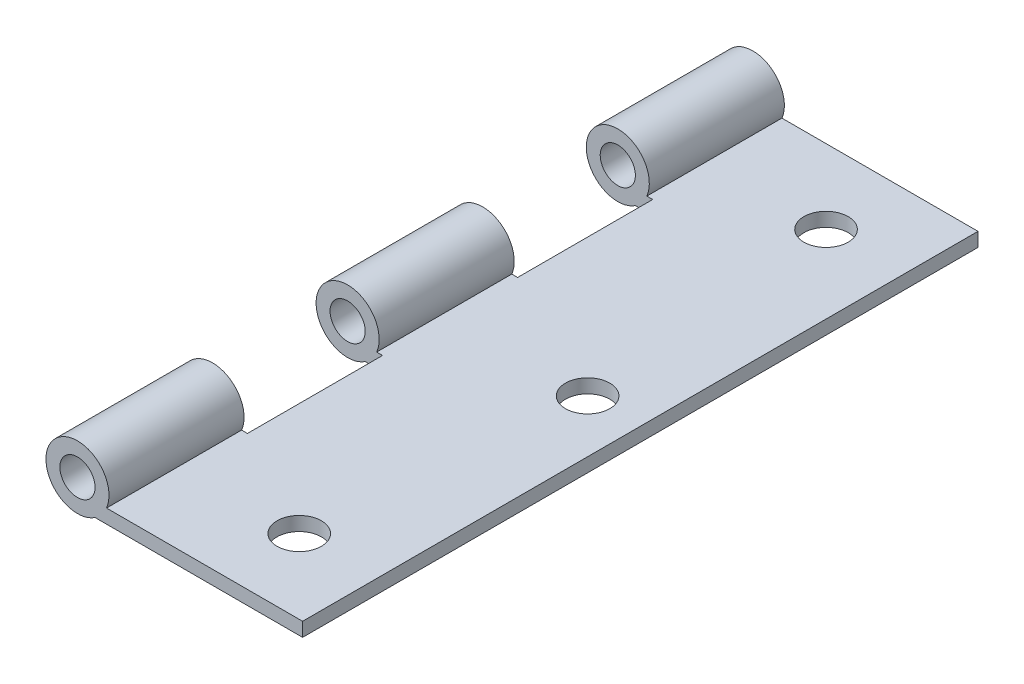
ISO-10303-21;
HEADER;
FILE_DESCRIPTION(('STEP AP214'),'2;1');
FILE_NAME('part.step','',(''),(''),'','','');
FILE_SCHEMA(('AUTOMOTIVE_DESIGN { 1 0 10303 214 1 1 1 1 }'));
ENDSEC;
DATA;
#1=APPLICATION_CONTEXT('core data for automotive mechanical design processes');
#2=APPLICATION_PROTOCOL_DEFINITION('international standard','automotive_design',2000,#1);
#3=PRODUCT_CONTEXT('',#1,'mechanical');
#4=PRODUCT('Part','Part','',(#3));
#5=PRODUCT_RELATED_PRODUCT_CATEGORY('part','',(#4));
#6=PRODUCT_DEFINITION_FORMATION('','',#4);
#7=PRODUCT_DEFINITION_CONTEXT('part definition',#1,'design');
#8=PRODUCT_DEFINITION('design','',#6,#7);
#9=PRODUCT_DEFINITION_SHAPE('','',#8);
#10=(LENGTH_UNIT() NAMED_UNIT(*) SI_UNIT(.MILLI.,.METRE.));
#11=(NAMED_UNIT(*) PLANE_ANGLE_UNIT() SI_UNIT($,.RADIAN.));
#12=(NAMED_UNIT(*) SI_UNIT($,.STERADIAN.) SOLID_ANGLE_UNIT());
#13=UNCERTAINTY_MEASURE_WITH_UNIT(LENGTH_MEASURE(1.E-05),#10,'distance_accuracy_value','');
#14=(GEOMETRIC_REPRESENTATION_CONTEXT(3) GLOBAL_UNCERTAINTY_ASSIGNED_CONTEXT((#13)) GLOBAL_UNIT_ASSIGNED_CONTEXT((#10,
#11,#12)) REPRESENTATION_CONTEXT('',''));
#15=CARTESIAN_POINT('',(0.,0.,0.));
#16=DIRECTION('',(0.,0.,1.));
#17=DIRECTION('',(1.,0.,0.));
#18=AXIS2_PLACEMENT_3D('',#15,#16,#17);
#19=CARTESIAN_POINT('',(1.984375,-2.95082901222266,-38.1));
#20=DIRECTION('',(0.,-1.,0.));
#21=DIRECTION('',(0.,0.,-1.));
#22=AXIS2_PLACEMENT_3D('',#19,#20,#21);
#23=PLANE('',#22);
#24=CARTESIAN_POINT('',(16.637,-2.95082901222266,29.718));
#25=DIRECTION('',(0.,-1.,0.));
#26=DIRECTION('',(0.,0.,-1.));
#27=AXIS2_PLACEMENT_3D('',#24,#25,#26);
#28=CIRCLE('',#27,2.5);
#29=CARTESIAN_POINT('',(16.637,-2.95082901222266,27.218));
#30=VERTEX_POINT('',#29);
#31=EDGE_CURVE('E249',#30,#30,#28,.F.);
#32=ORIENTED_EDGE('',*,*,#31,.T.);
#33=EDGE_LOOP('',(#32));
#34=FACE_BOUND('',#33,.T.);
#35=CARTESIAN_POINT('',(19.4564,-2.95082901222266,0.));
#36=DIRECTION('',(0.,-1.,0.));
#37=DIRECTION('',(0.,0.,-1.));
#38=AXIS2_PLACEMENT_3D('',#35,#36,#37);
#39=CIRCLE('',#38,2.5);
#40=CARTESIAN_POINT('',(19.4564,-2.95082901222266,-2.5));
#41=VERTEX_POINT('',#40);
#42=EDGE_CURVE('E243',#41,#41,#39,.F.);
#43=ORIENTED_EDGE('',*,*,#42,.T.);
#44=EDGE_LOOP('',(#43));
#45=FACE_BOUND('',#44,.T.);
#46=CARTESIAN_POINT('',(16.637,-2.95082901222266,-29.718));
#47=DIRECTION('',(0.,-1.,0.));
#48=DIRECTION('',(0.,0.,-1.));
#49=AXIS2_PLACEMENT_3D('',#46,#47,#48);
#50=CIRCLE('',#49,2.5);
#51=CARTESIAN_POINT('',(16.637,-2.95082901222266,-32.218));
#52=VERTEX_POINT('',#51);
#53=EDGE_CURVE('E237',#52,#52,#50,.F.);
#54=ORIENTED_EDGE('',*,*,#53,.T.);
#55=EDGE_LOOP('',(#54));
#56=FACE_BOUND('',#55,.T.);
#57=DIRECTION('',(0.,0.,1.));
#58=VECTOR('',#57,1.);
#59=CARTESIAN_POINT('',(1.984375,-2.95082901222267,-38.1));
#60=LINE('',#59,#58);
#61=CARTESIAN_POINT('',(1.984375,-2.95082901222266,22.86));
#62=VERTEX_POINT('',#61);
#63=CARTESIAN_POINT('',(1.984375,-2.95082901222267,38.1));
#64=VERTEX_POINT('',#63);
#65=EDGE_CURVE('E43',#62,#64,#60,.T.);
#66=ORIENTED_EDGE('',*,*,#65,.F.);
#67=DIRECTION('',(-1.,0.,0.));
#68=VECTOR('',#67,1.);
#69=CARTESIAN_POINT('',(3.937,-2.95082901222266,22.86));
#70=LINE('',#69,#68);
#71=CARTESIAN_POINT('',(3.937,-2.95082901222266,22.86));
#72=VERTEX_POINT('',#71);
#73=EDGE_CURVE('E131',#72,#62,#70,.T.);
#74=ORIENTED_EDGE('',*,*,#73,.F.);
#75=DIRECTION('',(0.,0.,-1.));
#76=VECTOR('',#75,1.);
#77=CARTESIAN_POINT('',(3.937,-2.95082901222266,22.86));
#78=LINE('',#77,#76);
#79=CARTESIAN_POINT('',(3.937,-2.95082901222266,7.62));
#80=VERTEX_POINT('',#79);
#81=EDGE_CURVE('E197',#72,#80,#78,.T.);
#82=ORIENTED_EDGE('',*,*,#81,.T.);
#83=DIRECTION('',(-1.,0.,0.));
#84=VECTOR('',#83,1.);
#85=CARTESIAN_POINT('',(3.937,-2.95082901222266,7.62));
#86=LINE('',#85,#84);
#87=CARTESIAN_POINT('',(1.984375,-2.95082901222266,7.62));
#88=VERTEX_POINT('',#87);
#89=EDGE_CURVE('E135',#80,#88,#86,.T.);
#90=ORIENTED_EDGE('',*,*,#89,.T.);
#91=CARTESIAN_POINT('',(1.984375,-2.95082901222266,-7.62));
#92=VERTEX_POINT('',#91);
#93=EDGE_CURVE('E41',#92,#88,#60,.T.);
#94=ORIENTED_EDGE('',*,*,#93,.F.);
#95=DIRECTION('',(-1.,0.,0.));
#96=VECTOR('',#95,1.);
#97=CARTESIAN_POINT('',(3.937,-2.95082901222266,-7.62));
#98=LINE('',#97,#96);
#99=CARTESIAN_POINT('',(3.937,-2.95082901222266,-7.62));
#100=VERTEX_POINT('',#99);
#101=EDGE_CURVE('E184',#100,#92,#98,.T.);
#102=ORIENTED_EDGE('',*,*,#101,.F.);
#103=DIRECTION('',(0.,0.,-1.));
#104=VECTOR('',#103,1.);
#105=CARTESIAN_POINT('',(3.937,-2.95082901222266,-7.62));
#106=LINE('',#105,#104);
#107=CARTESIAN_POINT('',(3.937,-2.95082901222266,-22.86));
#108=VERTEX_POINT('',#107);
#109=EDGE_CURVE('E171',#100,#108,#106,.T.);
#110=ORIENTED_EDGE('',*,*,#109,.T.);
#111=DIRECTION('',(-1.,0.,0.));
#112=VECTOR('',#111,1.);
#113=CARTESIAN_POINT('',(3.937,-2.95082901222266,-22.86));
#114=LINE('',#113,#112);
#115=CARTESIAN_POINT('',(1.984375,-2.95082901222266,-22.86));
#116=VERTEX_POINT('',#115);
#117=EDGE_CURVE('E187',#108,#116,#114,.T.);
#118=ORIENTED_EDGE('',*,*,#117,.T.);
#119=CARTESIAN_POINT('',(1.984375,-2.95082901222267,-38.1));
#120=VERTEX_POINT('',#119);
#121=EDGE_CURVE('E11',#120,#116,#60,.T.);
#122=ORIENTED_EDGE('',*,*,#121,.F.);
#123=DIRECTION('',(1.,0.,0.));
#124=VECTOR('',#123,1.);
#125=CARTESIAN_POINT('',(1.984375,-2.95082901222266,-38.1));
#126=LINE('',#125,#124);
#127=CARTESIAN_POINT('',(25.4,-2.95082901222266,-38.1));
#128=VERTEX_POINT('',#127);
#129=EDGE_CURVE('E162',#120,#128,#126,.T.);
#130=ORIENTED_EDGE('',*,*,#129,.T.);
#131=DIRECTION('',(0.,0.,1.));
#132=VECTOR('',#131,1.);
#133=CARTESIAN_POINT('',(25.4,-2.95082901222266,-38.1));
#134=LINE('',#133,#132);
#135=CARTESIAN_POINT('',(25.4,-2.95082901222266,38.1));
#136=VERTEX_POINT('',#135);
#137=EDGE_CURVE('E36',#128,#136,#134,.T.);
#138=ORIENTED_EDGE('',*,*,#137,.T.);
#139=DIRECTION('',(1.,0.,0.));
#140=VECTOR('',#139,1.);
#141=CARTESIAN_POINT('',(1.984375,-2.95082901222266,38.1));
#142=LINE('',#141,#140);
#143=EDGE_CURVE('E168',#64,#136,#142,.T.);
#144=ORIENTED_EDGE('',*,*,#143,.F.);
#145=EDGE_LOOP('',(#66,#74,#82,#90,#94,#102,#110,#118,#122,#130,#138,#144));
#146=FACE_BOUND('',#145,.T.);
#147=ADVANCED_FACE('F33',(#34,#45,#56,#146),#23,.T.);
#148=CARTESIAN_POINT('',(0.,0.,-38.1));
#149=DIRECTION('',(0.,0.,1.));
#150=DIRECTION('',(1.,0.,0.));
#151=AXIS2_PLACEMENT_3D('',#148,#149,#150);
#152=CYLINDRICAL_SURFACE('',#151,3.556);
#153=DIRECTION('',(0.,0.,1.));
#154=VECTOR('',#153,1.);
#155=CARTESIAN_POINT('',(3.27897547376029,-1.37602901222267,-38.1));
#156=LINE('',#155,#154);
#157=CARTESIAN_POINT('',(3.27897547376029,-1.37602901222267,22.86));
#158=VERTEX_POINT('',#157);
#159=CARTESIAN_POINT('',(3.27897547376029,-1.37602901222267,38.1));
#160=VERTEX_POINT('',#159);
#161=EDGE_CURVE('E140',#158,#160,#156,.T.);
#162=ORIENTED_EDGE('',*,*,#161,.F.);
#163=CARTESIAN_POINT('',(0.,0.,22.86));
#164=DIRECTION('',(0.,0.,-1.));
#165=DIRECTION('',(-1.,0.,0.));
#166=AXIS2_PLACEMENT_3D('',#163,#164,#165);
#167=CIRCLE('',#166,3.556);
#168=EDGE_CURVE('E124',#62,#158,#167,.T.);
#169=ORIENTED_EDGE('',*,*,#168,.F.);
#170=ORIENTED_EDGE('',*,*,#65,.T.);
#171=CARTESIAN_POINT('',(0.,0.,38.1));
#172=DIRECTION('',(0.,0.,1.));
#173=DIRECTION('',(1.,0.,0.));
#174=AXIS2_PLACEMENT_3D('',#171,#172,#173);
#175=CIRCLE('',#174,3.556);
#176=EDGE_CURVE('E149',#160,#64,#175,.T.);
#177=ORIENTED_EDGE('',*,*,#176,.F.);
#178=EDGE_LOOP('',(#162,#169,#170,#177));
#179=FACE_BOUND('',#178,.T.);
#180=ADVANCED_FACE('F147',(#179),#152,.T.);
#181=CARTESIAN_POINT('',(25.4,-1.37602901222267,-38.1));
#182=DIRECTION('',(0.,1.,0.));
#183=DIRECTION('',(0.,0.,1.));
#184=AXIS2_PLACEMENT_3D('',#181,#182,#183);
#185=PLANE('',#184);
#186=CARTESIAN_POINT('',(16.637,-1.37602901222267,29.718));
#187=DIRECTION('',(0.,1.,0.));
#188=DIRECTION('',(0.,0.,1.));
#189=AXIS2_PLACEMENT_3D('',#186,#187,#188);
#190=CIRCLE('',#189,2.5);
#191=CARTESIAN_POINT('',(16.637,-1.37602901222267,32.218));
#192=VERTEX_POINT('',#191);
#193=EDGE_CURVE('E252',#192,#192,#190,.T.);
#194=ORIENTED_EDGE('',*,*,#193,.F.);
#195=EDGE_LOOP('',(#194));
#196=FACE_BOUND('',#195,.T.);
#197=CARTESIAN_POINT('',(19.4564,-1.37602901222267,0.));
#198=DIRECTION('',(0.,1.,0.));
#199=DIRECTION('',(0.,0.,1.));
#200=AXIS2_PLACEMENT_3D('',#197,#198,#199);
#201=CIRCLE('',#200,2.5);
#202=CARTESIAN_POINT('',(19.4564,-1.37602901222267,2.5));
#203=VERTEX_POINT('',#202);
#204=EDGE_CURVE('E246',#203,#203,#201,.T.);
#205=ORIENTED_EDGE('',*,*,#204,.F.);
#206=EDGE_LOOP('',(#205));
#207=FACE_BOUND('',#206,.T.);
#208=CARTESIAN_POINT('',(16.637,-1.37602901222267,-29.718));
#209=DIRECTION('',(0.,1.,0.));
#210=DIRECTION('',(0.,0.,1.));
#211=AXIS2_PLACEMENT_3D('',#208,#209,#210);
#212=CIRCLE('',#211,2.5);
#213=CARTESIAN_POINT('',(16.637,-1.37602901222267,-27.218));
#214=VERTEX_POINT('',#213);
#215=EDGE_CURVE('E240',#214,#214,#212,.T.);
#216=ORIENTED_EDGE('',*,*,#215,.F.);
#217=EDGE_LOOP('',(#216));
#218=FACE_BOUND('',#217,.T.);
#219=DIRECTION('',(0.,0.,-1.));
#220=VECTOR('',#219,1.);
#221=CARTESIAN_POINT('',(3.937,-1.37602901222268,22.86));
#222=LINE('',#221,#220);
#223=CARTESIAN_POINT('',(3.937,-1.37602901222268,22.86));
#224=VERTEX_POINT('',#223);
#225=CARTESIAN_POINT('',(3.937,-1.37602901222267,7.62));
#226=VERTEX_POINT('',#225);
#227=EDGE_CURVE('E143',#224,#226,#222,.T.);
#228=ORIENTED_EDGE('',*,*,#227,.F.);
#229=DIRECTION('',(1.,0.,0.));
#230=VECTOR('',#229,1.);
#231=CARTESIAN_POINT('',(3.27897547376029,-1.37602901222267,22.86));
#232=LINE('',#231,#230);
#233=EDGE_CURVE('E128',#158,#224,#232,.T.);
#234=ORIENTED_EDGE('',*,*,#233,.F.);
#235=ORIENTED_EDGE('',*,*,#161,.T.);
#236=DIRECTION('',(-1.,0.,0.));
#237=VECTOR('',#236,1.);
#238=CARTESIAN_POINT('',(25.4,-1.37602901222267,38.1));
#239=LINE('',#238,#237);
#240=CARTESIAN_POINT('',(25.4,-1.37602901222267,38.1));
#241=VERTEX_POINT('',#240);
#242=EDGE_CURVE('E163',#241,#160,#239,.T.);
#243=ORIENTED_EDGE('',*,*,#242,.F.);
#244=DIRECTION('',(0.,0.,1.));
#245=VECTOR('',#244,1.);
#246=CARTESIAN_POINT('',(25.4,-1.37602901222267,-38.1));
#247=LINE('',#246,#245);
#248=CARTESIAN_POINT('',(25.4,-1.37602901222267,-38.1));
#249=VERTEX_POINT('',#248);
#250=EDGE_CURVE('E151',#249,#241,#247,.T.);
#251=ORIENTED_EDGE('',*,*,#250,.F.);
#252=DIRECTION('',(-1.,0.,0.));
#253=VECTOR('',#252,1.);
#254=CARTESIAN_POINT('',(25.4,-1.37602901222267,-38.1));
#255=LINE('',#254,#253);
#256=CARTESIAN_POINT('',(3.27897547376029,-1.37602901222267,-38.1));
#257=VERTEX_POINT('',#256);
#258=EDGE_CURVE('E175',#249,#257,#255,.T.);
#259=ORIENTED_EDGE('',*,*,#258,.T.);
#260=CARTESIAN_POINT('',(3.27897547376029,-1.37602901222267,-22.86));
#261=VERTEX_POINT('',#260);
#262=EDGE_CURVE('E153',#257,#261,#156,.T.);
#263=ORIENTED_EDGE('',*,*,#262,.T.);
#264=DIRECTION('',(1.,0.,0.));
#265=VECTOR('',#264,1.);
#266=CARTESIAN_POINT('',(3.27897547376029,-1.37602901222267,-22.86));
#267=LINE('',#266,#265);
#268=CARTESIAN_POINT('',(3.937,-1.37602901222267,-22.86));
#269=VERTEX_POINT('',#268);
#270=EDGE_CURVE('E192',#261,#269,#267,.T.);
#271=ORIENTED_EDGE('',*,*,#270,.T.);
#272=DIRECTION('',(0.,0.,-1.));
#273=VECTOR('',#272,1.);
#274=CARTESIAN_POINT('',(3.937,-1.37602901222268,-7.62));
#275=LINE('',#274,#273);
#276=CARTESIAN_POINT('',(3.937,-1.37602901222268,-7.62));
#277=VERTEX_POINT('',#276);
#278=EDGE_CURVE('E182',#277,#269,#275,.T.);
#279=ORIENTED_EDGE('',*,*,#278,.F.);
#280=DIRECTION('',(1.,0.,0.));
#281=VECTOR('',#280,1.);
#282=CARTESIAN_POINT('',(3.27897547376029,-1.37602901222267,-7.62));
#283=LINE('',#282,#281);
#284=CARTESIAN_POINT('',(3.27897547376029,-1.37602901222267,-7.62));
#285=VERTEX_POINT('',#284);
#286=EDGE_CURVE('E202',#285,#277,#283,.T.);
#287=ORIENTED_EDGE('',*,*,#286,.F.);
#288=CARTESIAN_POINT('',(3.27897547376029,-1.37602901222267,7.62));
#289=VERTEX_POINT('',#288);
#290=EDGE_CURVE('E150',#285,#289,#156,.T.);
#291=ORIENTED_EDGE('',*,*,#290,.T.);
#292=DIRECTION('',(1.,0.,0.));
#293=VECTOR('',#292,1.);
#294=CARTESIAN_POINT('',(3.27897547376029,-1.37602901222267,7.62));
#295=LINE('',#294,#293);
#296=EDGE_CURVE('E212',#289,#226,#295,.T.);
#297=ORIENTED_EDGE('',*,*,#296,.T.);
#298=EDGE_LOOP('',(#228,#234,#235,#243,#251,#259,#263,#271,#279,#287,#291,#297));
#299=FACE_BOUND('',#298,.T.);
#300=ADVANCED_FACE('F138',(#196,#207,#218,#299),#185,.T.);
#301=CARTESIAN_POINT('',(0.,0.,7.62));
#302=DIRECTION('',(0.,0.,-1.));
#303=DIRECTION('',(-1.,0.,0.));
#304=AXIS2_PLACEMENT_3D('',#301,#302,#303);
#305=CIRCLE('',#304,3.556);
#306=EDGE_CURVE('E214',#88,#289,#305,.T.);
#307=ORIENTED_EDGE('',*,*,#306,.T.);
#308=ORIENTED_EDGE('',*,*,#290,.F.);
#309=CARTESIAN_POINT('',(0.,0.,-7.62));
#310=DIRECTION('',(0.,0.,-1.));
#311=DIRECTION('',(-1.,0.,0.));
#312=AXIS2_PLACEMENT_3D('',#309,#310,#311);
#313=CIRCLE('',#312,3.556);
#314=EDGE_CURVE('E190',#92,#285,#313,.T.);
#315=ORIENTED_EDGE('',*,*,#314,.F.);
#316=ORIENTED_EDGE('',*,*,#93,.T.);
#317=EDGE_LOOP('',(#307,#308,#315,#316));
#318=FACE_BOUND('',#317,.T.);
#319=ADVANCED_FACE('F261',(#318),#152,.T.);
#320=CARTESIAN_POINT('',(0.,0.,-22.86));
#321=DIRECTION('',(0.,0.,-1.));
#322=DIRECTION('',(-1.,0.,0.));
#323=AXIS2_PLACEMENT_3D('',#320,#321,#322);
#324=CIRCLE('',#323,3.556);
#325=EDGE_CURVE('E194',#116,#261,#324,.T.);
#326=ORIENTED_EDGE('',*,*,#325,.T.);
#327=ORIENTED_EDGE('',*,*,#262,.F.);
#328=CARTESIAN_POINT('',(0.,0.,-38.1));
#329=DIRECTION('',(0.,0.,1.));
#330=DIRECTION('',(1.,0.,0.));
#331=AXIS2_PLACEMENT_3D('',#328,#329,#330);
#332=CIRCLE('',#331,3.556);
#333=EDGE_CURVE('E172',#257,#120,#332,.T.);
#334=ORIENTED_EDGE('',*,*,#333,.T.);
#335=ORIENTED_EDGE('',*,*,#121,.T.);
#336=EDGE_LOOP('',(#326,#327,#334,#335));
#337=FACE_BOUND('',#336,.T.);
#338=ADVANCED_FACE('F290',(#337),#152,.T.);
#339=CARTESIAN_POINT('',(25.4,-2.95082901222266,-38.1));
#340=DIRECTION('',(1.,0.,0.));
#341=DIRECTION('',(0.,0.,-1.));
#342=AXIS2_PLACEMENT_3D('',#339,#340,#341);
#343=PLANE('',#342);
#344=DIRECTION('',(0.,1.,0.));
#345=VECTOR('',#344,1.);
#346=CARTESIAN_POINT('',(25.4,-2.95082901222266,38.1));
#347=LINE('',#346,#345);
#348=EDGE_CURVE('E165',#136,#241,#347,.T.);
#349=ORIENTED_EDGE('',*,*,#348,.F.);
#350=ORIENTED_EDGE('',*,*,#137,.F.);
#351=DIRECTION('',(0.,1.,0.));
#352=VECTOR('',#351,1.);
#353=CARTESIAN_POINT('',(25.4,-2.95082901222266,-38.1));
#354=LINE('',#353,#352);
#355=EDGE_CURVE('E177',#128,#249,#354,.T.);
#356=ORIENTED_EDGE('',*,*,#355,.T.);
#357=ORIENTED_EDGE('',*,*,#250,.T.);
#358=EDGE_LOOP('',(#349,#350,#356,#357));
#359=FACE_BOUND('',#358,.T.);
#360=ADVANCED_FACE('F288',(#359),#343,.T.);
#361=CARTESIAN_POINT('',(0.,0.,-38.1));
#362=DIRECTION('',(0.,0.,1.));
#363=DIRECTION('',(1.,0.,0.));
#364=AXIS2_PLACEMENT_3D('',#361,#362,#363);
#365=PLANE('',#364);
#366=CARTESIAN_POINT('',(0.,0.,-38.1));
#367=DIRECTION('',(0.,0.,-1.));
#368=DIRECTION('',(-1.,0.,0.));
#369=AXIS2_PLACEMENT_3D('',#366,#367,#368);
#370=CIRCLE('',#369,1.98437499999999);
#371=CARTESIAN_POINT('',(-1.98437499999999,0.,-38.1));
#372=VERTEX_POINT('',#371);
#373=EDGE_CURVE('E228',#372,#372,#370,.T.);
#374=ORIENTED_EDGE('',*,*,#373,.F.);
#375=EDGE_LOOP('',(#374));
#376=FACE_BOUND('',#375,.T.);
#377=ORIENTED_EDGE('',*,*,#129,.F.);
#378=ORIENTED_EDGE('',*,*,#333,.F.);
#379=ORIENTED_EDGE('',*,*,#258,.F.);
#380=ORIENTED_EDGE('',*,*,#355,.F.);
#381=EDGE_LOOP('',(#377,#378,#379,#380));
#382=FACE_BOUND('',#381,.T.);
#383=ADVANCED_FACE('F287',(#376,#382),#365,.F.);
#384=CARTESIAN_POINT('',(0.,0.,38.1));
#385=DIRECTION('',(0.,0.,1.));
#386=DIRECTION('',(1.,0.,0.));
#387=AXIS2_PLACEMENT_3D('',#384,#385,#386);
#388=PLANE('',#387);
#389=CARTESIAN_POINT('',(0.,0.,38.1));
#390=DIRECTION('',(0.,0.,1.));
#391=DIRECTION('',(1.,0.,0.));
#392=AXIS2_PLACEMENT_3D('',#389,#390,#391);
#393=CIRCLE('',#392,1.98437499999999);
#394=CARTESIAN_POINT('',(1.98437499999999,0.,38.1));
#395=VERTEX_POINT('',#394);
#396=EDGE_CURVE('E222',#395,#395,#393,.T.);
#397=ORIENTED_EDGE('',*,*,#396,.F.);
#398=EDGE_LOOP('',(#397));
#399=FACE_BOUND('',#398,.T.);
#400=ORIENTED_EDGE('',*,*,#143,.T.);
#401=ORIENTED_EDGE('',*,*,#348,.T.);
#402=ORIENTED_EDGE('',*,*,#242,.T.);
#403=ORIENTED_EDGE('',*,*,#176,.T.);
#404=EDGE_LOOP('',(#400,#401,#402,#403));
#405=FACE_BOUND('',#404,.T.);
#406=ADVANCED_FACE('F280',(#399,#405),#388,.T.);
#407=CARTESIAN_POINT('',(3.937,-1.37602901222268,-7.62));
#408=DIRECTION('',(1.,0.,0.));
#409=DIRECTION('',(0.,0.,-1.));
#410=AXIS2_PLACEMENT_3D('',#407,#408,#409);
#411=PLANE('',#410);
#412=DIRECTION('',(0.,-1.,0.));
#413=VECTOR('',#412,1.);
#414=CARTESIAN_POINT('',(3.937,-1.37602901222268,-22.86));
#415=LINE('',#414,#413);
#416=EDGE_CURVE('E58',#269,#108,#415,.T.);
#417=ORIENTED_EDGE('',*,*,#416,.T.);
#418=ORIENTED_EDGE('',*,*,#109,.F.);
#419=DIRECTION('',(0.,-1.,0.));
#420=VECTOR('',#419,1.);
#421=CARTESIAN_POINT('',(3.937,-1.37602901222268,-7.62));
#422=LINE('',#421,#420);
#423=EDGE_CURVE('E199',#277,#100,#422,.T.);
#424=ORIENTED_EDGE('',*,*,#423,.F.);
#425=ORIENTED_EDGE('',*,*,#278,.T.);
#426=EDGE_LOOP('',(#417,#418,#424,#425));
#427=FACE_BOUND('',#426,.T.);
#428=ADVANCED_FACE('F301',(#427),#411,.F.);
#429=CARTESIAN_POINT('',(0.,0.,-7.62));
#430=DIRECTION('',(0.,0.,-1.));
#431=DIRECTION('',(-1.,0.,0.));
#432=AXIS2_PLACEMENT_3D('',#429,#430,#431);
#433=PLANE('',#432);
#434=CARTESIAN_POINT('',(0.,0.,-7.62));
#435=DIRECTION('',(0.,0.,-1.));
#436=DIRECTION('',(-1.,0.,0.));
#437=AXIS2_PLACEMENT_3D('',#434,#435,#436);
#438=CIRCLE('',#437,1.98437499999999);
#439=CARTESIAN_POINT('',(-1.98437499999999,0.,-7.62));
#440=VERTEX_POINT('',#439);
#441=EDGE_CURVE('E234',#440,#440,#438,.T.);
#442=ORIENTED_EDGE('',*,*,#441,.F.);
#443=EDGE_LOOP('',(#442));
#444=FACE_BOUND('',#443,.T.);
#445=ORIENTED_EDGE('',*,*,#314,.T.);
#446=ORIENTED_EDGE('',*,*,#286,.T.);
#447=ORIENTED_EDGE('',*,*,#423,.T.);
#448=ORIENTED_EDGE('',*,*,#101,.T.);
#449=EDGE_LOOP('',(#445,#446,#447,#448));
#450=FACE_BOUND('',#449,.T.);
#451=ADVANCED_FACE('F306',(#444,#450),#433,.T.);
#452=CARTESIAN_POINT('',(0.,0.,-22.86));
#453=DIRECTION('',(0.,0.,-1.));
#454=DIRECTION('',(-1.,0.,0.));
#455=AXIS2_PLACEMENT_3D('',#452,#453,#454);
#456=PLANE('',#455);
#457=CARTESIAN_POINT('',(0.,0.,-22.86));
#458=DIRECTION('',(0.,0.,-1.));
#459=DIRECTION('',(-1.,0.,0.));
#460=AXIS2_PLACEMENT_3D('',#457,#458,#459);
#461=CIRCLE('',#460,1.98437499999999);
#462=CARTESIAN_POINT('',(-1.98437499999999,0.,-22.86));
#463=VERTEX_POINT('',#462);
#464=EDGE_CURVE('E225',#463,#463,#461,.T.);
#465=ORIENTED_EDGE('',*,*,#464,.T.);
#466=EDGE_LOOP('',(#465));
#467=FACE_BOUND('',#466,.T.);
#468=ORIENTED_EDGE('',*,*,#325,.F.);
#469=ORIENTED_EDGE('',*,*,#117,.F.);
#470=ORIENTED_EDGE('',*,*,#416,.F.);
#471=ORIENTED_EDGE('',*,*,#270,.F.);
#472=EDGE_LOOP('',(#468,#469,#470,#471));
#473=FACE_BOUND('',#472,.T.);
#474=ADVANCED_FACE('F308',(#467,#473),#456,.F.);
#475=CARTESIAN_POINT('',(3.937,-1.37602901222268,22.86));
#476=DIRECTION('',(1.,0.,0.));
#477=DIRECTION('',(0.,0.,-1.));
#478=AXIS2_PLACEMENT_3D('',#475,#476,#477);
#479=PLANE('',#478);
#480=DIRECTION('',(0.,-1.,0.));
#481=VECTOR('',#480,1.);
#482=CARTESIAN_POINT('',(3.937,-1.37602901222268,7.62));
#483=LINE('',#482,#481);
#484=EDGE_CURVE('E50',#226,#80,#483,.T.);
#485=ORIENTED_EDGE('',*,*,#484,.T.);
#486=ORIENTED_EDGE('',*,*,#81,.F.);
#487=DIRECTION('',(0.,-1.,0.));
#488=VECTOR('',#487,1.);
#489=CARTESIAN_POINT('',(3.937,-1.37602901222268,22.86));
#490=LINE('',#489,#488);
#491=EDGE_CURVE('E144',#224,#72,#490,.T.);
#492=ORIENTED_EDGE('',*,*,#491,.F.);
#493=ORIENTED_EDGE('',*,*,#227,.T.);
#494=EDGE_LOOP('',(#485,#486,#492,#493));
#495=FACE_BOUND('',#494,.T.);
#496=ADVANCED_FACE('F311',(#495),#479,.F.);
#497=CARTESIAN_POINT('',(0.,0.,22.86));
#498=DIRECTION('',(0.,0.,-1.));
#499=DIRECTION('',(-1.,0.,0.));
#500=AXIS2_PLACEMENT_3D('',#497,#498,#499);
#501=PLANE('',#500);
#502=CARTESIAN_POINT('',(0.,0.,22.86));
#503=DIRECTION('',(0.,0.,-1.));
#504=DIRECTION('',(-1.,0.,0.));
#505=AXIS2_PLACEMENT_3D('',#502,#503,#504);
#506=CIRCLE('',#505,1.98437499999999);
#507=CARTESIAN_POINT('',(-1.98437499999999,0.,22.86));
#508=VERTEX_POINT('',#507);
#509=EDGE_CURVE('E217',#508,#508,#506,.T.);
#510=ORIENTED_EDGE('',*,*,#509,.F.);
#511=EDGE_LOOP('',(#510));
#512=FACE_BOUND('',#511,.T.);
#513=ORIENTED_EDGE('',*,*,#168,.T.);
#514=ORIENTED_EDGE('',*,*,#233,.T.);
#515=ORIENTED_EDGE('',*,*,#491,.T.);
#516=ORIENTED_EDGE('',*,*,#73,.T.);
#517=EDGE_LOOP('',(#513,#514,#515,#516));
#518=FACE_BOUND('',#517,.T.);
#519=ADVANCED_FACE('F126',(#512,#518),#501,.T.);
#520=CARTESIAN_POINT('',(0.,0.,7.62));
#521=DIRECTION('',(0.,0.,-1.));
#522=DIRECTION('',(-1.,0.,0.));
#523=AXIS2_PLACEMENT_3D('',#520,#521,#522);
#524=PLANE('',#523);
#525=CARTESIAN_POINT('',(0.,0.,7.62));
#526=DIRECTION('',(0.,0.,-1.));
#527=DIRECTION('',(-1.,0.,0.));
#528=AXIS2_PLACEMENT_3D('',#525,#526,#527);
#529=CIRCLE('',#528,1.98437499999999);
#530=CARTESIAN_POINT('',(-1.98437499999999,0.,7.62));
#531=VERTEX_POINT('',#530);
#532=EDGE_CURVE('E231',#531,#531,#529,.T.);
#533=ORIENTED_EDGE('',*,*,#532,.T.);
#534=EDGE_LOOP('',(#533));
#535=FACE_BOUND('',#534,.T.);
#536=ORIENTED_EDGE('',*,*,#306,.F.);
#537=ORIENTED_EDGE('',*,*,#89,.F.);
#538=ORIENTED_EDGE('',*,*,#484,.F.);
#539=ORIENTED_EDGE('',*,*,#296,.F.);
#540=EDGE_LOOP('',(#536,#537,#538,#539));
#541=FACE_BOUND('',#540,.T.);
#542=ADVANCED_FACE('F319',(#535,#541),#524,.F.);
#543=CARTESIAN_POINT('',(0.,0.,38.1));
#544=DIRECTION('',(0.,0.,1.));
#545=DIRECTION('',(1.,0.,0.));
#546=AXIS2_PLACEMENT_3D('',#543,#544,#545);
#547=CYLINDRICAL_SURFACE('',#546,1.98437499999999);
#548=ORIENTED_EDGE('',*,*,#396,.T.);
#549=EDGE_LOOP('',(#548));
#550=FACE_BOUND('',#549,.T.);
#551=ORIENTED_EDGE('',*,*,#509,.T.);
#552=EDGE_LOOP('',(#551));
#553=FACE_BOUND('',#552,.T.);
#554=ADVANCED_FACE('F322',(#550,#553),#547,.F.);
#555=CARTESIAN_POINT('',(0.,0.,-38.1));
#556=DIRECTION('',(0.,0.,-1.));
#557=DIRECTION('',(-1.,0.,0.));
#558=AXIS2_PLACEMENT_3D('',#555,#556,#557);
#559=CYLINDRICAL_SURFACE('',#558,1.98437499999999);
#560=ORIENTED_EDGE('',*,*,#464,.F.);
#561=EDGE_LOOP('',(#560));
#562=FACE_BOUND('',#561,.T.);
#563=ORIENTED_EDGE('',*,*,#373,.T.);
#564=EDGE_LOOP('',(#563));
#565=FACE_BOUND('',#564,.T.);
#566=ADVANCED_FACE('F329',(#562,#565),#559,.F.);
#567=CARTESIAN_POINT('',(0.,0.,-7.62));
#568=DIRECTION('',(0.,0.,-1.));
#569=DIRECTION('',(-1.,0.,0.));
#570=AXIS2_PLACEMENT_3D('',#567,#568,#569);
#571=CYLINDRICAL_SURFACE('',#570,1.98437499999999);
#572=ORIENTED_EDGE('',*,*,#441,.T.);
#573=EDGE_LOOP('',(#572));
#574=FACE_BOUND('',#573,.T.);
#575=ORIENTED_EDGE('',*,*,#532,.F.);
#576=EDGE_LOOP('',(#575));
#577=FACE_BOUND('',#576,.T.);
#578=ADVANCED_FACE('F271',(#574,#577),#571,.F.);
#579=CARTESIAN_POINT('',(16.637,-10.0218968240881,-29.718));
#580=DIRECTION('',(0.,1.,0.));
#581=DIRECTION('',(0.,0.,1.));
#582=AXIS2_PLACEMENT_3D('',#579,#580,#581);
#583=CYLINDRICAL_SURFACE('',#582,2.5);
#584=ORIENTED_EDGE('',*,*,#215,.T.);
#585=EDGE_LOOP('',(#584));
#586=FACE_BOUND('',#585,.T.);
#587=ORIENTED_EDGE('',*,*,#53,.F.);
#588=EDGE_LOOP('',(#587));
#589=FACE_BOUND('',#588,.T.);
#590=ADVANCED_FACE('F267',(#586,#589),#583,.F.);
#591=CARTESIAN_POINT('',(19.4564,-10.0218968240881,0.));
#592=DIRECTION('',(0.,1.,0.));
#593=DIRECTION('',(0.,0.,1.));
#594=AXIS2_PLACEMENT_3D('',#591,#592,#593);
#595=CYLINDRICAL_SURFACE('',#594,2.5);
#596=ORIENTED_EDGE('',*,*,#204,.T.);
#597=EDGE_LOOP('',(#596));
#598=FACE_BOUND('',#597,.T.);
#599=ORIENTED_EDGE('',*,*,#42,.F.);
#600=EDGE_LOOP('',(#599));
#601=FACE_BOUND('',#600,.T.);
#602=ADVANCED_FACE('F270',(#598,#601),#595,.F.);
#603=CARTESIAN_POINT('',(16.637,-10.0218968240881,29.718));
#604=DIRECTION('',(0.,1.,0.));
#605=DIRECTION('',(0.,0.,1.));
#606=AXIS2_PLACEMENT_3D('',#603,#604,#605);
#607=CYLINDRICAL_SURFACE('',#606,2.5);
#608=ORIENTED_EDGE('',*,*,#193,.T.);
#609=EDGE_LOOP('',(#608));
#610=FACE_BOUND('',#609,.T.);
#611=ORIENTED_EDGE('',*,*,#31,.F.);
#612=EDGE_LOOP('',(#611));
#613=FACE_BOUND('',#612,.T.);
#614=ADVANCED_FACE('F256',(#610,#613),#607,.F.);
#615=CLOSED_SHELL('',(#147,#180,#300,#319,#338,#360,#383,#406,#428,#451,#474,#496,#519,#542,
#554,#566,#578,#590,#602,#614));
#616=MANIFOLD_SOLID_BREP('B2',#615);
#617=ADVANCED_BREP_SHAPE_REPRESENTATION('',(#18,#616),#14);
#618=SHAPE_DEFINITION_REPRESENTATION(#9,#617);
ENDSEC;
END-ISO-10303-21;
